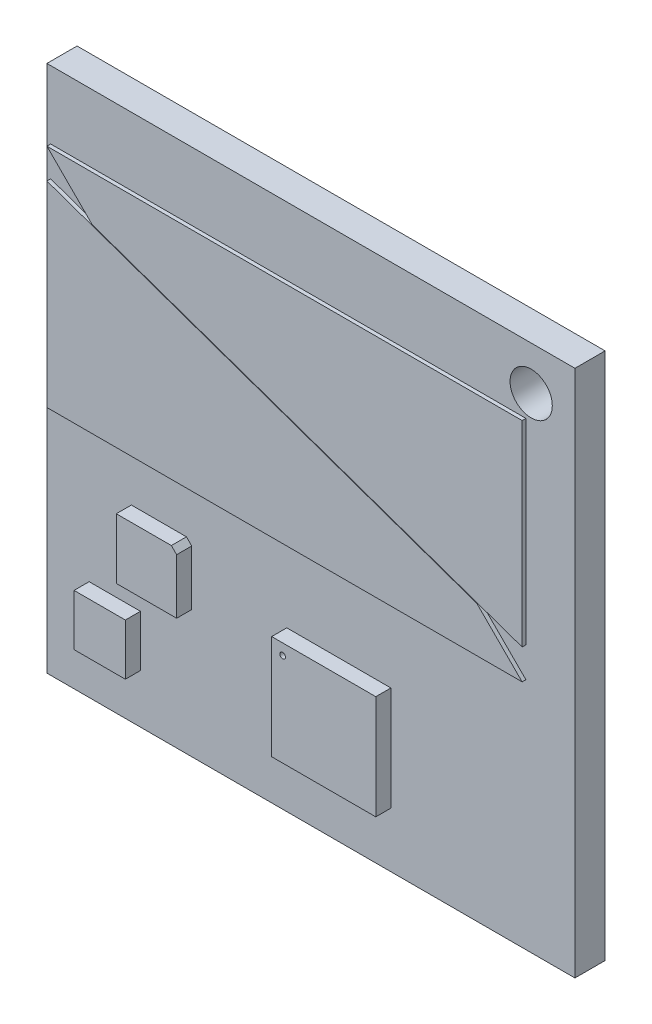
ISO-10303-21;
HEADER;
FILE_DESCRIPTION(('STEP AP214'),'2;1');
FILE_NAME('part.step','',(''),(''),'','','');
FILE_SCHEMA(('AUTOMOTIVE_DESIGN { 1 0 10303 214 1 1 1 1 }'));
ENDSEC;
DATA;
#1=APPLICATION_CONTEXT('core data for automotive mechanical design processes');
#2=APPLICATION_PROTOCOL_DEFINITION('international standard','automotive_design',2000,#1);
#3=PRODUCT_CONTEXT('',#1,'mechanical');
#4=PRODUCT('Part','Part','',(#3));
#5=PRODUCT_RELATED_PRODUCT_CATEGORY('part','',(#4));
#6=PRODUCT_DEFINITION_FORMATION('','',#4);
#7=PRODUCT_DEFINITION_CONTEXT('part definition',#1,'design');
#8=PRODUCT_DEFINITION('design','',#6,#7);
#9=PRODUCT_DEFINITION_SHAPE('','',#8);
#10=(LENGTH_UNIT() NAMED_UNIT(*) SI_UNIT(.MILLI.,.METRE.));
#11=(NAMED_UNIT(*) PLANE_ANGLE_UNIT() SI_UNIT($,.RADIAN.));
#12=(NAMED_UNIT(*) SI_UNIT($,.STERADIAN.) SOLID_ANGLE_UNIT());
#13=UNCERTAINTY_MEASURE_WITH_UNIT(LENGTH_MEASURE(1.E-05),#10,'distance_accuracy_value','');
#14=(GEOMETRIC_REPRESENTATION_CONTEXT(3) GLOBAL_UNCERTAINTY_ASSIGNED_CONTEXT((#13)) GLOBAL_UNIT_ASSIGNED_CONTEXT((#10,
#11,#12)) REPRESENTATION_CONTEXT('',''));
#15=CARTESIAN_POINT('',(0.,0.,0.));
#16=DIRECTION('',(0.,0.,1.));
#17=DIRECTION('',(1.,0.,0.));
#18=AXIS2_PLACEMENT_3D('',#15,#16,#17);
#19=CARTESIAN_POINT('',(0.,0.,0.));
#20=DIRECTION('',(0.,0.,1.));
#21=DIRECTION('',(1.,0.,0.));
#22=AXIS2_PLACEMENT_3D('',#19,#20,#21);
#23=PLANE('',#22);
#24=DIRECTION('',(1.,0.,0.));
#25=VECTOR('',#24,1.);
#26=CARTESIAN_POINT('',(0.,6.65,0.));
#27=LINE('',#26,#25);
#28=CARTESIAN_POINT('',(2.8,6.65,0.));
#29=VERTEX_POINT('',#28);
#30=CARTESIAN_POINT('',(6.2,6.65,0.));
#31=VERTEX_POINT('',#30);
#32=EDGE_CURVE('E333',#29,#31,#27,.T.);
#33=ORIENTED_EDGE('',*,*,#32,.T.);
#34=DIRECTION('',(0.,1.,0.));
#35=VECTOR('',#34,1.);
#36=CARTESIAN_POINT('',(6.2,0.,0.));
#37=LINE('',#36,#35);
#38=CARTESIAN_POINT('',(6.2,3.25,0.));
#39=VERTEX_POINT('',#38);
#40=EDGE_CURVE('E338',#39,#31,#37,.T.);
#41=ORIENTED_EDGE('',*,*,#40,.F.);
#42=DIRECTION('',(1.,0.,0.));
#43=VECTOR('',#42,1.);
#44=CARTESIAN_POINT('',(0.,3.25,0.));
#45=LINE('',#44,#43);
#46=CARTESIAN_POINT('',(2.8,3.25,0.));
#47=VERTEX_POINT('',#46);
#48=EDGE_CURVE('E349',#47,#39,#45,.T.);
#49=ORIENTED_EDGE('',*,*,#48,.F.);
#50=DIRECTION('',(0.,-1.,0.));
#51=VECTOR('',#50,1.);
#52=CARTESIAN_POINT('',(2.8,0.,0.));
#53=LINE('',#52,#51);
#54=EDGE_CURVE('E347',#29,#47,#53,.T.);
#55=ORIENTED_EDGE('',*,*,#54,.F.);
#56=EDGE_LOOP('',(#33,#41,#49,#55));
#57=FACE_BOUND('',#56,.T.);
#58=CARTESIAN_POINT('',(32.1,32.1,0.));
#59=DIRECTION('',(0.,0.,1.));
#60=DIRECTION('',(1.,0.,0.));
#61=AXIS2_PLACEMENT_3D('',#58,#59,#60);
#62=CIRCLE('',#61,1.4);
#63=CARTESIAN_POINT('',(33.5,32.1,0.));
#64=VERTEX_POINT('',#63);
#65=EDGE_CURVE('E396',#64,#64,#62,.T.);
#66=ORIENTED_EDGE('',*,*,#65,.F.);
#67=EDGE_LOOP('',(#66));
#68=FACE_BOUND('',#67,.T.);
#69=DIRECTION('',(0.,1.,0.));
#70=VECTOR('',#69,1.);
#71=CARTESIAN_POINT('',(35.,0.,0.));
#72=LINE('',#71,#70);
#73=CARTESIAN_POINT('',(35.,0.,0.));
#74=VERTEX_POINT('',#73);
#75=CARTESIAN_POINT('',(35.,35.,0.));
#76=VERTEX_POINT('',#75);
#77=EDGE_CURVE('E400',#74,#76,#72,.T.);
#78=ORIENTED_EDGE('',*,*,#77,.T.);
#79=DIRECTION('',(-1.,0.,0.));
#80=VECTOR('',#79,1.);
#81=CARTESIAN_POINT('',(35.,35.,0.));
#82=LINE('',#81,#80);
#83=CARTESIAN_POINT('',(0.,35.,0.));
#84=VERTEX_POINT('',#83);
#85=EDGE_CURVE('E419',#76,#84,#82,.T.);
#86=ORIENTED_EDGE('',*,*,#85,.T.);
#87=DIRECTION('',(0.,-1.,0.));
#88=VECTOR('',#87,1.);
#89=CARTESIAN_POINT('',(0.,35.,0.));
#90=LINE('',#89,#88);
#91=CARTESIAN_POINT('',(0.,0.,0.));
#92=VERTEX_POINT('',#91);
#93=EDGE_CURVE('E422',#84,#92,#90,.T.);
#94=ORIENTED_EDGE('',*,*,#93,.T.);
#95=DIRECTION('',(1.,0.,0.));
#96=VECTOR('',#95,1.);
#97=CARTESIAN_POINT('',(0.,0.,0.));
#98=LINE('',#97,#96);
#99=EDGE_CURVE('E407',#92,#74,#98,.T.);
#100=ORIENTED_EDGE('',*,*,#99,.T.);
#101=EDGE_LOOP('',(#78,#86,#94,#100));
#102=FACE_BOUND('',#101,.T.);
#103=DIRECTION('',(0.,1.,0.));
#104=VECTOR('',#103,1.);
#105=CARTESIAN_POINT('',(22.8,0.,0.));
#106=LINE('',#105,#104);
#107=CARTESIAN_POINT('',(22.8,3.65,0.));
#108=VERTEX_POINT('',#107);
#109=CARTESIAN_POINT('',(22.8,10.55,0.));
#110=VERTEX_POINT('',#109);
#111=EDGE_CURVE('E380',#108,#110,#106,.T.);
#112=ORIENTED_EDGE('',*,*,#111,.F.);
#113=DIRECTION('',(1.,0.,0.));
#114=VECTOR('',#113,1.);
#115=CARTESIAN_POINT('',(0.,3.65,0.));
#116=LINE('',#115,#114);
#117=CARTESIAN_POINT('',(15.9,3.65,0.));
#118=VERTEX_POINT('',#117);
#119=EDGE_CURVE('E362',#118,#108,#116,.T.);
#120=ORIENTED_EDGE('',*,*,#119,.F.);
#121=DIRECTION('',(0.,-1.,0.));
#122=VECTOR('',#121,1.);
#123=CARTESIAN_POINT('',(15.9,0.,0.));
#124=LINE('',#123,#122);
#125=CARTESIAN_POINT('',(15.9,10.55,0.));
#126=VERTEX_POINT('',#125);
#127=EDGE_CURVE('E367',#126,#118,#124,.T.);
#128=ORIENTED_EDGE('',*,*,#127,.F.);
#129=DIRECTION('',(1.,0.,0.));
#130=VECTOR('',#129,1.);
#131=CARTESIAN_POINT('',(0.,10.55,0.));
#132=LINE('',#131,#130);
#133=EDGE_CURVE('E383',#126,#110,#132,.T.);
#134=ORIENTED_EDGE('',*,*,#133,.T.);
#135=EDGE_LOOP('',(#112,#120,#128,#134));
#136=FACE_BOUND('',#135,.T.);
#137=DIRECTION('',(0.,1.,0.));
#138=VECTOR('',#137,1.);
#139=CARTESIAN_POINT('',(5.6,0.,0.));
#140=LINE('',#139,#138);
#141=CARTESIAN_POINT('',(5.6,8.45,0.));
#142=VERTEX_POINT('',#141);
#143=CARTESIAN_POINT('',(5.6,12.45,0.));
#144=VERTEX_POINT('',#143);
#145=EDGE_CURVE('E313',#142,#144,#140,.T.);
#146=ORIENTED_EDGE('',*,*,#145,.T.);
#147=DIRECTION('',(-1.,0.,0.));
#148=VECTOR('',#147,1.);
#149=CARTESIAN_POINT('',(0.,12.45,0.));
#150=LINE('',#149,#148);
#151=CARTESIAN_POINT('',(9.25,12.45,0.));
#152=VERTEX_POINT('',#151);
#153=EDGE_CURVE('E296',#152,#144,#150,.T.);
#154=ORIENTED_EDGE('',*,*,#153,.F.);
#155=DIRECTION('',(-0.707106781186548,0.707106781186548,0.));
#156=VECTOR('',#155,1.);
#157=CARTESIAN_POINT('',(10.85,10.85,0.));
#158=LINE('',#157,#156);
#159=CARTESIAN_POINT('',(9.6,12.1,0.));
#160=VERTEX_POINT('',#159);
#161=EDGE_CURVE('E300',#160,#152,#158,.T.);
#162=ORIENTED_EDGE('',*,*,#161,.F.);
#163=DIRECTION('',(0.,1.,0.));
#164=VECTOR('',#163,1.);
#165=CARTESIAN_POINT('',(9.59999999999996,0.,0.));
#166=LINE('',#165,#164);
#167=CARTESIAN_POINT('',(9.6,8.45,0.));
#168=VERTEX_POINT('',#167);
#169=EDGE_CURVE('E319',#168,#160,#166,.T.);
#170=ORIENTED_EDGE('',*,*,#169,.F.);
#171=DIRECTION('',(-1.,0.,0.));
#172=VECTOR('',#171,1.);
#173=CARTESIAN_POINT('',(0.,8.45,0.));
#174=LINE('',#173,#172);
#175=EDGE_CURVE('E316',#168,#142,#174,.T.);
#176=ORIENTED_EDGE('',*,*,#175,.T.);
#177=EDGE_LOOP('',(#146,#154,#162,#170,#176));
#178=FACE_BOUND('',#177,.T.);
#179=DIRECTION('',(0.943599982132881,-0.331087713029081,0.));
#180=VECTOR('',#179,1.);
#181=CARTESIAN_POINT('',(8.94765689229926,25.5008221430529,0.));
#182=LINE('',#181,#180);
#183=CARTESIAN_POINT('',(3.25,27.5,0.));
#184=VERTEX_POINT('',#183);
#185=CARTESIAN_POINT('',(31.75,17.5,0.));
#186=VERTEX_POINT('',#185);
#187=EDGE_CURVE('E279',#184,#186,#182,.T.);
#188=ORIENTED_EDGE('',*,*,#187,.F.);
#189=DIRECTION('',(0.707106781186548,-0.707106781186547,0.));
#190=VECTOR('',#189,1.);
#191=CARTESIAN_POINT('',(15.375,15.375,0.));
#192=LINE('',#191,#190);
#193=CARTESIAN_POINT('',(0.25,30.5,0.));
#194=VERTEX_POINT('',#193);
#195=EDGE_CURVE('E245',#194,#184,#192,.T.);
#196=ORIENTED_EDGE('',*,*,#195,.F.);
#197=DIRECTION('',(1.,0.,0.));
#198=VECTOR('',#197,1.);
#199=CARTESIAN_POINT('',(0.,30.5,0.));
#200=LINE('',#199,#198);
#201=CARTESIAN_POINT('',(31.75,30.5,0.));
#202=VERTEX_POINT('',#201);
#203=EDGE_CURVE('E268',#194,#202,#200,.T.);
#204=ORIENTED_EDGE('',*,*,#203,.T.);
#205=DIRECTION('',(0.,-1.,0.));
#206=VECTOR('',#205,1.);
#207=CARTESIAN_POINT('',(31.75,0.,0.));
#208=LINE('',#207,#206);
#209=EDGE_CURVE('E282',#202,#186,#208,.T.);
#210=ORIENTED_EDGE('',*,*,#209,.T.);
#211=EDGE_LOOP('',(#188,#196,#204,#210));
#212=FACE_BOUND('',#211,.T.);
#213=DIRECTION('',(0.707106781186547,-0.707106781186548,0.));
#214=VECTOR('',#213,1.);
#215=CARTESIAN_POINT('',(23.625,23.625,0.));
#216=LINE('',#215,#214);
#217=CARTESIAN_POINT('',(28.75,18.5,0.));
#218=VERTEX_POINT('',#217);
#219=CARTESIAN_POINT('',(31.75,15.5,0.));
#220=VERTEX_POINT('',#219);
#221=EDGE_CURVE('E75',#218,#220,#216,.T.);
#222=ORIENTED_EDGE('',*,*,#221,.T.);
#223=DIRECTION('',(1.,0.,0.));
#224=VECTOR('',#223,1.);
#225=CARTESIAN_POINT('',(0.,15.5,0.));
#226=LINE('',#225,#224);
#227=CARTESIAN_POINT('',(0.25,15.5,0.));
#228=VERTEX_POINT('',#227);
#229=EDGE_CURVE('E243',#228,#220,#226,.T.);
#230=ORIENTED_EDGE('',*,*,#229,.F.);
#231=DIRECTION('',(0.,1.,0.));
#232=VECTOR('',#231,1.);
#233=CARTESIAN_POINT('',(0.25,0.,0.));
#234=LINE('',#233,#232);
#235=CARTESIAN_POINT('',(0.25,28.5,0.));
#236=VERTEX_POINT('',#235);
#237=EDGE_CURVE('E238',#228,#236,#234,.T.);
#238=ORIENTED_EDGE('',*,*,#237,.T.);
#239=DIRECTION('',(0.943599982132881,-0.331087713029081,0.));
#240=VECTOR('',#239,1.);
#241=CARTESIAN_POINT('',(8.93121403124143,25.4539599890381,0.));
#242=LINE('',#241,#240);
#243=EDGE_CURVE('E80',#236,#218,#242,.T.);
#244=ORIENTED_EDGE('',*,*,#243,.T.);
#245=EDGE_LOOP('',(#222,#230,#238,#244));
#246=FACE_BOUND('',#245,.T.);
#247=ADVANCED_FACE('F60',(#57,#68,#102,#136,#178,#212,#246),#23,.T.);
#248=CARTESIAN_POINT('',(35.,0.,-2.));
#249=DIRECTION('',(1.,0.,0.));
#250=DIRECTION('',(0.,0.,-1.));
#251=AXIS2_PLACEMENT_3D('',#248,#249,#250);
#252=PLANE('',#251);
#253=ORIENTED_EDGE('',*,*,#77,.F.);
#254=DIRECTION('',(0.,0.,1.));
#255=VECTOR('',#254,1.);
#256=CARTESIAN_POINT('',(35.,0.,-2.));
#257=LINE('',#256,#255);
#258=CARTESIAN_POINT('',(35.,0.,-2.));
#259=VERTEX_POINT('',#258);
#260=EDGE_CURVE('E68',#259,#74,#257,.T.);
#261=ORIENTED_EDGE('',*,*,#260,.F.);
#262=DIRECTION('',(0.,1.,0.));
#263=VECTOR('',#262,1.);
#264=CARTESIAN_POINT('',(35.,0.,-2.));
#265=LINE('',#264,#263);
#266=CARTESIAN_POINT('',(35.,35.,-2.));
#267=VERTEX_POINT('',#266);
#268=EDGE_CURVE('E403',#259,#267,#265,.T.);
#269=ORIENTED_EDGE('',*,*,#268,.T.);
#270=DIRECTION('',(0.,0.,1.));
#271=VECTOR('',#270,1.);
#272=CARTESIAN_POINT('',(35.,35.,-2.));
#273=LINE('',#272,#271);
#274=EDGE_CURVE('E416',#267,#76,#273,.T.);
#275=ORIENTED_EDGE('',*,*,#274,.T.);
#276=EDGE_LOOP('',(#253,#261,#269,#275));
#277=FACE_BOUND('',#276,.T.);
#278=ADVANCED_FACE('F62',(#277),#252,.T.);
#279=CARTESIAN_POINT('',(0.,0.,-2.));
#280=DIRECTION('',(0.,-1.,0.));
#281=DIRECTION('',(0.,0.,-1.));
#282=AXIS2_PLACEMENT_3D('',#279,#280,#281);
#283=PLANE('',#282);
#284=ORIENTED_EDGE('',*,*,#99,.F.);
#285=DIRECTION('',(0.,0.,1.));
#286=VECTOR('',#285,1.);
#287=CARTESIAN_POINT('',(0.,0.,-2.));
#288=LINE('',#287,#286);
#289=CARTESIAN_POINT('',(0.,0.,-2.));
#290=VERTEX_POINT('',#289);
#291=EDGE_CURVE('E428',#290,#92,#288,.T.);
#292=ORIENTED_EDGE('',*,*,#291,.F.);
#293=DIRECTION('',(1.,0.,0.));
#294=VECTOR('',#293,1.);
#295=CARTESIAN_POINT('',(0.,0.,-2.));
#296=LINE('',#295,#294);
#297=EDGE_CURVE('E413',#290,#259,#296,.T.);
#298=ORIENTED_EDGE('',*,*,#297,.T.);
#299=ORIENTED_EDGE('',*,*,#260,.T.);
#300=EDGE_LOOP('',(#284,#292,#298,#299));
#301=FACE_BOUND('',#300,.T.);
#302=ADVANCED_FACE('F443',(#301),#283,.T.);
#303=CARTESIAN_POINT('',(0.,35.,-2.));
#304=DIRECTION('',(-1.,0.,0.));
#305=DIRECTION('',(0.,0.,1.));
#306=AXIS2_PLACEMENT_3D('',#303,#304,#305);
#307=PLANE('',#306);
#308=ORIENTED_EDGE('',*,*,#93,.F.);
#309=DIRECTION('',(0.,0.,1.));
#310=VECTOR('',#309,1.);
#311=CARTESIAN_POINT('',(0.,35.,-2.));
#312=LINE('',#311,#310);
#313=CARTESIAN_POINT('',(0.,35.,-2.));
#314=VERTEX_POINT('',#313);
#315=EDGE_CURVE('E430',#314,#84,#312,.T.);
#316=ORIENTED_EDGE('',*,*,#315,.F.);
#317=DIRECTION('',(0.,-1.,0.));
#318=VECTOR('',#317,1.);
#319=CARTESIAN_POINT('',(0.,35.,-2.));
#320=LINE('',#319,#318);
#321=EDGE_CURVE('E410',#314,#290,#320,.T.);
#322=ORIENTED_EDGE('',*,*,#321,.T.);
#323=ORIENTED_EDGE('',*,*,#291,.T.);
#324=EDGE_LOOP('',(#308,#316,#322,#323));
#325=FACE_BOUND('',#324,.T.);
#326=ADVANCED_FACE('F449',(#325),#307,.T.);
#327=CARTESIAN_POINT('',(35.,35.,-2.));
#328=DIRECTION('',(0.,1.,0.));
#329=DIRECTION('',(0.,0.,1.));
#330=AXIS2_PLACEMENT_3D('',#327,#328,#329);
#331=PLANE('',#330);
#332=ORIENTED_EDGE('',*,*,#85,.F.);
#333=ORIENTED_EDGE('',*,*,#274,.F.);
#334=DIRECTION('',(-1.,0.,0.));
#335=VECTOR('',#334,1.);
#336=CARTESIAN_POINT('',(35.,35.,-2.));
#337=LINE('',#336,#335);
#338=EDGE_CURVE('E406',#267,#314,#337,.T.);
#339=ORIENTED_EDGE('',*,*,#338,.T.);
#340=ORIENTED_EDGE('',*,*,#315,.T.);
#341=EDGE_LOOP('',(#332,#333,#339,#340));
#342=FACE_BOUND('',#341,.T.);
#343=ADVANCED_FACE('F437',(#342),#331,.T.);
#344=CARTESIAN_POINT('',(0.,0.,-2.));
#345=DIRECTION('',(0.,0.,1.));
#346=DIRECTION('',(1.,0.,0.));
#347=AXIS2_PLACEMENT_3D('',#344,#345,#346);
#348=PLANE('',#347);
#349=CARTESIAN_POINT('',(32.1,32.1,-2.));
#350=DIRECTION('',(0.,0.,1.));
#351=DIRECTION('',(1.,0.,0.));
#352=AXIS2_PLACEMENT_3D('',#349,#350,#351);
#353=CIRCLE('',#352,1.4);
#354=CARTESIAN_POINT('',(33.5,32.1,-2.));
#355=VERTEX_POINT('',#354);
#356=EDGE_CURVE('E397',#355,#355,#353,.T.);
#357=ORIENTED_EDGE('',*,*,#356,.T.);
#358=EDGE_LOOP('',(#357));
#359=FACE_BOUND('',#358,.T.);
#360=ORIENTED_EDGE('',*,*,#268,.F.);
#361=ORIENTED_EDGE('',*,*,#297,.F.);
#362=ORIENTED_EDGE('',*,*,#321,.F.);
#363=ORIENTED_EDGE('',*,*,#338,.F.);
#364=EDGE_LOOP('',(#360,#361,#362,#363));
#365=FACE_BOUND('',#364,.T.);
#366=ADVANCED_FACE('F446',(#359,#365),#348,.F.);
#367=CARTESIAN_POINT('',(32.1,32.1,-2.));
#368=DIRECTION('',(0.,0.,1.));
#369=DIRECTION('',(1.,0.,0.));
#370=AXIS2_PLACEMENT_3D('',#367,#368,#369);
#371=CYLINDRICAL_SURFACE('',#370,1.4);
#372=ORIENTED_EDGE('',*,*,#356,.F.);
#373=EDGE_LOOP('',(#372));
#374=FACE_BOUND('',#373,.T.);
#375=ORIENTED_EDGE('',*,*,#65,.T.);
#376=EDGE_LOOP('',(#375));
#377=FACE_BOUND('',#376,.T.);
#378=ADVANCED_FACE('F500',(#374,#377),#371,.F.);
#379=CARTESIAN_POINT('',(0.,3.65,1.));
#380=DIRECTION('',(0.,1.,0.));
#381=DIRECTION('',(0.,0.,1.));
#382=AXIS2_PLACEMENT_3D('',#379,#380,#381);
#383=PLANE('',#382);
#384=ORIENTED_EDGE('',*,*,#119,.T.);
#385=DIRECTION('',(0.,0.,-1.));
#386=VECTOR('',#385,1.);
#387=CARTESIAN_POINT('',(22.8,3.65,1.));
#388=LINE('',#387,#386);
#389=CARTESIAN_POINT('',(22.8,3.65,1.));
#390=VERTEX_POINT('',#389);
#391=EDGE_CURVE('E394',#390,#108,#388,.T.);
#392=ORIENTED_EDGE('',*,*,#391,.F.);
#393=DIRECTION('',(1.,0.,0.));
#394=VECTOR('',#393,1.);
#395=CARTESIAN_POINT('',(0.,3.65,1.));
#396=LINE('',#395,#394);
#397=CARTESIAN_POINT('',(15.9,3.65,1.));
#398=VERTEX_POINT('',#397);
#399=EDGE_CURVE('E366',#398,#390,#396,.T.);
#400=ORIENTED_EDGE('',*,*,#399,.F.);
#401=DIRECTION('',(0.,0.,-1.));
#402=VECTOR('',#401,1.);
#403=CARTESIAN_POINT('',(15.9,3.65,1.));
#404=LINE('',#403,#402);
#405=EDGE_CURVE('E377',#398,#118,#404,.T.);
#406=ORIENTED_EDGE('',*,*,#405,.T.);
#407=EDGE_LOOP('',(#384,#392,#400,#406));
#408=FACE_BOUND('',#407,.T.);
#409=ADVANCED_FACE('F498',(#408),#383,.F.);
#410=CARTESIAN_POINT('',(22.8,0.,1.));
#411=DIRECTION('',(-1.,0.,0.));
#412=DIRECTION('',(0.,0.,1.));
#413=AXIS2_PLACEMENT_3D('',#410,#411,#412);
#414=PLANE('',#413);
#415=ORIENTED_EDGE('',*,*,#111,.T.);
#416=DIRECTION('',(0.,0.,-1.));
#417=VECTOR('',#416,1.);
#418=CARTESIAN_POINT('',(22.8,10.55,1.));
#419=LINE('',#418,#417);
#420=CARTESIAN_POINT('',(22.8,10.55,1.));
#421=VERTEX_POINT('',#420);
#422=EDGE_CURVE('E392',#421,#110,#419,.T.);
#423=ORIENTED_EDGE('',*,*,#422,.F.);
#424=DIRECTION('',(0.,1.,0.));
#425=VECTOR('',#424,1.);
#426=CARTESIAN_POINT('',(22.8,0.,1.));
#427=LINE('',#426,#425);
#428=EDGE_CURVE('E370',#390,#421,#427,.T.);
#429=ORIENTED_EDGE('',*,*,#428,.F.);
#430=ORIENTED_EDGE('',*,*,#391,.T.);
#431=EDGE_LOOP('',(#415,#423,#429,#430));
#432=FACE_BOUND('',#431,.T.);
#433=ADVANCED_FACE('F493',(#432),#414,.F.);
#434=CARTESIAN_POINT('',(0.,10.55,1.));
#435=DIRECTION('',(0.,1.,0.));
#436=DIRECTION('',(0.,0.,1.));
#437=AXIS2_PLACEMENT_3D('',#434,#435,#436);
#438=PLANE('',#437);
#439=ORIENTED_EDGE('',*,*,#133,.F.);
#440=DIRECTION('',(0.,0.,-1.));
#441=VECTOR('',#440,1.);
#442=CARTESIAN_POINT('',(15.9,10.55,1.));
#443=LINE('',#442,#441);
#444=CARTESIAN_POINT('',(15.9,10.55,1.));
#445=VERTEX_POINT('',#444);
#446=EDGE_CURVE('E389',#445,#126,#443,.T.);
#447=ORIENTED_EDGE('',*,*,#446,.F.);
#448=DIRECTION('',(1.,0.,0.));
#449=VECTOR('',#448,1.);
#450=CARTESIAN_POINT('',(0.,10.55,1.));
#451=LINE('',#450,#449);
#452=EDGE_CURVE('E372',#445,#421,#451,.T.);
#453=ORIENTED_EDGE('',*,*,#452,.T.);
#454=ORIENTED_EDGE('',*,*,#422,.T.);
#455=EDGE_LOOP('',(#439,#447,#453,#454));
#456=FACE_BOUND('',#455,.T.);
#457=ADVANCED_FACE('F484',(#456),#438,.T.);
#458=CARTESIAN_POINT('',(16.63,9.82,1.));
#459=DIRECTION('',(0.,0.,-1.));
#460=DIRECTION('',(-1.,0.,0.));
#461=AXIS2_PLACEMENT_3D('',#458,#459,#460);
#462=CYLINDRICAL_SURFACE('',#461,0.1855);
#463=CARTESIAN_POINT('',(16.63,9.82,1.));
#464=DIRECTION('',(0.,0.,1.));
#465=DIRECTION('',(1.,0.,0.));
#466=AXIS2_PLACEMENT_3D('',#463,#464,#465);
#467=CIRCLE('',#466,0.1855);
#468=CARTESIAN_POINT('',(16.8155,9.82,1.));
#469=VERTEX_POINT('',#468);
#470=EDGE_CURVE('E363',#469,#469,#467,.T.);
#471=ORIENTED_EDGE('',*,*,#470,.T.);
#472=EDGE_LOOP('',(#471));
#473=FACE_BOUND('',#472,.T.);
#474=CARTESIAN_POINT('',(16.63,9.82,0.));
#475=DIRECTION('',(0.,0.,1.));
#476=DIRECTION('',(1.,0.,0.));
#477=AXIS2_PLACEMENT_3D('',#474,#475,#476);
#478=CIRCLE('',#477,0.1855);
#479=CARTESIAN_POINT('',(16.8155,9.82,0.));
#480=VERTEX_POINT('',#479);
#481=EDGE_CURVE('E12',#480,#480,#478,.F.);
#482=ORIENTED_EDGE('',*,*,#481,.T.);
#483=EDGE_LOOP('',(#482));
#484=FACE_BOUND('',#483,.T.);
#485=ADVANCED_FACE('F482',(#473,#484),#462,.F.);
#486=CARTESIAN_POINT('',(15.9,0.,1.));
#487=DIRECTION('',(1.,0.,0.));
#488=DIRECTION('',(0.,0.,-1.));
#489=AXIS2_PLACEMENT_3D('',#486,#487,#488);
#490=PLANE('',#489);
#491=ORIENTED_EDGE('',*,*,#127,.T.);
#492=ORIENTED_EDGE('',*,*,#405,.F.);
#493=DIRECTION('',(0.,-1.,0.));
#494=VECTOR('',#493,1.);
#495=CARTESIAN_POINT('',(15.9,0.,1.));
#496=LINE('',#495,#494);
#497=EDGE_CURVE('E375',#445,#398,#496,.T.);
#498=ORIENTED_EDGE('',*,*,#497,.F.);
#499=ORIENTED_EDGE('',*,*,#446,.T.);
#500=EDGE_LOOP('',(#491,#492,#498,#499));
#501=FACE_BOUND('',#500,.T.);
#502=ADVANCED_FACE('F477',(#501),#490,.F.);
#503=CARTESIAN_POINT('',(0.,0.,1.));
#504=DIRECTION('',(0.,0.,1.));
#505=DIRECTION('',(1.,0.,0.));
#506=AXIS2_PLACEMENT_3D('',#503,#504,#505);
#507=PLANE('',#506);
#508=ORIENTED_EDGE('',*,*,#470,.F.);
#509=EDGE_LOOP('',(#508));
#510=FACE_BOUND('',#509,.T.);
#511=ORIENTED_EDGE('',*,*,#399,.T.);
#512=ORIENTED_EDGE('',*,*,#428,.T.);
#513=ORIENTED_EDGE('',*,*,#452,.F.);
#514=ORIENTED_EDGE('',*,*,#497,.T.);
#515=EDGE_LOOP('',(#511,#512,#513,#514));
#516=FACE_BOUND('',#515,.T.);
#517=ADVANCED_FACE('F468',(#510,#516),#507,.T.);
#518=ORIENTED_EDGE('',*,*,#481,.F.);
#519=EDGE_LOOP('',(#518));
#520=FACE_BOUND('',#519,.T.);
#521=ADVANCED_FACE('F460',(#520),#23,.T.);
#522=CARTESIAN_POINT('',(0.,6.65,1.));
#523=DIRECTION('',(0.,1.,0.));
#524=DIRECTION('',(0.,0.,1.));
#525=AXIS2_PLACEMENT_3D('',#522,#523,#524);
#526=PLANE('',#525);
#527=ORIENTED_EDGE('',*,*,#32,.F.);
#528=DIRECTION('',(0.,0.,-1.));
#529=VECTOR('',#528,1.);
#530=CARTESIAN_POINT('',(2.8,6.65,1.));
#531=LINE('',#530,#529);
#532=CARTESIAN_POINT('',(2.8,6.65,1.));
#533=VERTEX_POINT('',#532);
#534=EDGE_CURVE('E360',#533,#29,#531,.T.);
#535=ORIENTED_EDGE('',*,*,#534,.F.);
#536=DIRECTION('',(1.,0.,0.));
#537=VECTOR('',#536,1.);
#538=CARTESIAN_POINT('',(0.,6.65,1.));
#539=LINE('',#538,#537);
#540=CARTESIAN_POINT('',(6.2,6.65,1.));
#541=VERTEX_POINT('',#540);
#542=EDGE_CURVE('E334',#533,#541,#539,.T.);
#543=ORIENTED_EDGE('',*,*,#542,.T.);
#544=DIRECTION('',(0.,0.,-1.));
#545=VECTOR('',#544,1.);
#546=CARTESIAN_POINT('',(6.2,6.65,1.));
#547=LINE('',#546,#545);
#548=EDGE_CURVE('E344',#541,#31,#547,.T.);
#549=ORIENTED_EDGE('',*,*,#548,.T.);
#550=EDGE_LOOP('',(#527,#535,#543,#549));
#551=FACE_BOUND('',#550,.T.);
#552=ADVANCED_FACE('F467',(#551),#526,.T.);
#553=CARTESIAN_POINT('',(2.8,0.,1.));
#554=DIRECTION('',(1.,0.,0.));
#555=DIRECTION('',(0.,1.,0.));
#556=AXIS2_PLACEMENT_3D('',#553,#554,#555);
#557=PLANE('',#556);
#558=ORIENTED_EDGE('',*,*,#54,.T.);
#559=DIRECTION('',(0.,0.,-1.));
#560=VECTOR('',#559,1.);
#561=CARTESIAN_POINT('',(2.8,3.25,1.));
#562=LINE('',#561,#560);
#563=CARTESIAN_POINT('',(2.8,3.25,1.));
#564=VERTEX_POINT('',#563);
#565=EDGE_CURVE('E357',#564,#47,#562,.T.);
#566=ORIENTED_EDGE('',*,*,#565,.F.);
#567=DIRECTION('',(0.,-1.,0.));
#568=VECTOR('',#567,1.);
#569=CARTESIAN_POINT('',(2.8,0.,1.));
#570=LINE('',#569,#568);
#571=EDGE_CURVE('E337',#533,#564,#570,.T.);
#572=ORIENTED_EDGE('',*,*,#571,.F.);
#573=ORIENTED_EDGE('',*,*,#534,.T.);
#574=EDGE_LOOP('',(#558,#566,#572,#573));
#575=FACE_BOUND('',#574,.T.);
#576=ADVANCED_FACE('F474',(#575),#557,.F.);
#577=CARTESIAN_POINT('',(0.,3.25,1.));
#578=DIRECTION('',(0.,1.,0.));
#579=DIRECTION('',(0.,0.,1.));
#580=AXIS2_PLACEMENT_3D('',#577,#578,#579);
#581=PLANE('',#580);
#582=ORIENTED_EDGE('',*,*,#48,.T.);
#583=DIRECTION('',(0.,0.,-1.));
#584=VECTOR('',#583,1.);
#585=CARTESIAN_POINT('',(6.2,3.25,1.));
#586=LINE('',#585,#584);
#587=CARTESIAN_POINT('',(6.2,3.25,1.));
#588=VERTEX_POINT('',#587);
#589=EDGE_CURVE('E355',#588,#39,#586,.T.);
#590=ORIENTED_EDGE('',*,*,#589,.F.);
#591=DIRECTION('',(1.,0.,0.));
#592=VECTOR('',#591,1.);
#593=CARTESIAN_POINT('',(0.,3.25,1.));
#594=LINE('',#593,#592);
#595=EDGE_CURVE('E340',#564,#588,#594,.T.);
#596=ORIENTED_EDGE('',*,*,#595,.F.);
#597=ORIENTED_EDGE('',*,*,#565,.T.);
#598=EDGE_LOOP('',(#582,#590,#596,#597));
#599=FACE_BOUND('',#598,.T.);
#600=ADVANCED_FACE('F569',(#599),#581,.F.);
#601=CARTESIAN_POINT('',(6.2,0.,1.));
#602=DIRECTION('',(-1.,0.,0.));
#603=DIRECTION('',(0.,0.,1.));
#604=AXIS2_PLACEMENT_3D('',#601,#602,#603);
#605=PLANE('',#604);
#606=ORIENTED_EDGE('',*,*,#40,.T.);
#607=ORIENTED_EDGE('',*,*,#548,.F.);
#608=DIRECTION('',(0.,1.,0.));
#609=VECTOR('',#608,1.);
#610=CARTESIAN_POINT('',(6.2,0.,1.));
#611=LINE('',#610,#609);
#612=EDGE_CURVE('E342',#588,#541,#611,.T.);
#613=ORIENTED_EDGE('',*,*,#612,.F.);
#614=ORIENTED_EDGE('',*,*,#589,.T.);
#615=EDGE_LOOP('',(#606,#607,#613,#614));
#616=FACE_BOUND('',#615,.T.);
#617=ADVANCED_FACE('F581',(#616),#605,.F.);
#618=CARTESIAN_POINT('',(0.,0.,1.));
#619=DIRECTION('',(0.,0.,1.));
#620=DIRECTION('',(1.,0.,0.));
#621=AXIS2_PLACEMENT_3D('',#618,#619,#620);
#622=PLANE('',#621);
#623=ORIENTED_EDGE('',*,*,#542,.F.);
#624=ORIENTED_EDGE('',*,*,#571,.T.);
#625=ORIENTED_EDGE('',*,*,#595,.T.);
#626=ORIENTED_EDGE('',*,*,#612,.T.);
#627=EDGE_LOOP('',(#623,#624,#625,#626));
#628=FACE_BOUND('',#627,.T.);
#629=ADVANCED_FACE('F593',(#628),#622,.T.);
#630=CARTESIAN_POINT('',(0.,12.45,1.));
#631=DIRECTION('',(0.,-1.,0.));
#632=DIRECTION('',(0.,0.,-1.));
#633=AXIS2_PLACEMENT_3D('',#630,#631,#632);
#634=PLANE('',#633);
#635=ORIENTED_EDGE('',*,*,#153,.T.);
#636=DIRECTION('',(0.,0.,-1.));
#637=VECTOR('',#636,1.);
#638=CARTESIAN_POINT('',(5.6,12.45,1.));
#639=LINE('',#638,#637);
#640=CARTESIAN_POINT('',(5.6,12.45,1.));
#641=VERTEX_POINT('',#640);
#642=EDGE_CURVE('E331',#641,#144,#639,.T.);
#643=ORIENTED_EDGE('',*,*,#642,.F.);
#644=DIRECTION('',(-1.,0.,0.));
#645=VECTOR('',#644,1.);
#646=CARTESIAN_POINT('',(0.,12.45,1.));
#647=LINE('',#646,#645);
#648=CARTESIAN_POINT('',(9.25,12.45,1.));
#649=VERTEX_POINT('',#648);
#650=EDGE_CURVE('E297',#649,#641,#647,.T.);
#651=ORIENTED_EDGE('',*,*,#650,.F.);
#652=DIRECTION('',(0.,0.,-1.));
#653=VECTOR('',#652,1.);
#654=CARTESIAN_POINT('',(9.25,12.45,1.));
#655=LINE('',#654,#653);
#656=EDGE_CURVE('E310',#649,#152,#655,.T.);
#657=ORIENTED_EDGE('',*,*,#656,.T.);
#658=EDGE_LOOP('',(#635,#643,#651,#657));
#659=FACE_BOUND('',#658,.T.);
#660=ADVANCED_FACE('F603',(#659),#634,.F.);
#661=CARTESIAN_POINT('',(5.6,0.,1.));
#662=DIRECTION('',(-1.,0.,0.));
#663=DIRECTION('',(0.,0.,1.));
#664=AXIS2_PLACEMENT_3D('',#661,#662,#663);
#665=PLANE('',#664);
#666=ORIENTED_EDGE('',*,*,#145,.F.);
#667=DIRECTION('',(0.,0.,-1.));
#668=VECTOR('',#667,1.);
#669=CARTESIAN_POINT('',(5.6,8.45,1.));
#670=LINE('',#669,#668);
#671=CARTESIAN_POINT('',(5.6,8.45,1.));
#672=VERTEX_POINT('',#671);
#673=EDGE_CURVE('E329',#672,#142,#670,.T.);
#674=ORIENTED_EDGE('',*,*,#673,.F.);
#675=DIRECTION('',(0.,1.,0.));
#676=VECTOR('',#675,1.);
#677=CARTESIAN_POINT('',(5.6,0.,1.));
#678=LINE('',#677,#676);
#679=EDGE_CURVE('E299',#672,#641,#678,.T.);
#680=ORIENTED_EDGE('',*,*,#679,.T.);
#681=ORIENTED_EDGE('',*,*,#642,.T.);
#682=EDGE_LOOP('',(#666,#674,#680,#681));
#683=FACE_BOUND('',#682,.T.);
#684=ADVANCED_FACE('F614',(#683),#665,.T.);
#685=CARTESIAN_POINT('',(0.,8.45,1.));
#686=DIRECTION('',(0.,-1.,0.));
#687=DIRECTION('',(0.,0.,-1.));
#688=AXIS2_PLACEMENT_3D('',#685,#686,#687);
#689=PLANE('',#688);
#690=ORIENTED_EDGE('',*,*,#175,.F.);
#691=DIRECTION('',(0.,0.,-1.));
#692=VECTOR('',#691,1.);
#693=CARTESIAN_POINT('',(9.6,8.45,1.));
#694=LINE('',#693,#692);
#695=CARTESIAN_POINT('',(9.6,8.45,1.));
#696=VERTEX_POINT('',#695);
#697=EDGE_CURVE('E327',#696,#168,#694,.T.);
#698=ORIENTED_EDGE('',*,*,#697,.F.);
#699=DIRECTION('',(-1.,0.,0.));
#700=VECTOR('',#699,1.);
#701=CARTESIAN_POINT('',(0.,8.45,1.));
#702=LINE('',#701,#700);
#703=EDGE_CURVE('E303',#696,#672,#702,.T.);
#704=ORIENTED_EDGE('',*,*,#703,.T.);
#705=ORIENTED_EDGE('',*,*,#673,.T.);
#706=EDGE_LOOP('',(#690,#698,#704,#705));
#707=FACE_BOUND('',#706,.T.);
#708=ADVANCED_FACE('F625',(#707),#689,.T.);
#709=CARTESIAN_POINT('',(9.59999999999996,0.,1.));
#710=DIRECTION('',(-1.,0.,0.));
#711=DIRECTION('',(0.,-1.,0.));
#712=AXIS2_PLACEMENT_3D('',#709,#710,#711);
#713=PLANE('',#712);
#714=ORIENTED_EDGE('',*,*,#169,.T.);
#715=DIRECTION('',(0.,0.,-1.));
#716=VECTOR('',#715,1.);
#717=CARTESIAN_POINT('',(9.6,12.1,1.));
#718=LINE('',#717,#716);
#719=CARTESIAN_POINT('',(9.6,12.1,1.));
#720=VERTEX_POINT('',#719);
#721=EDGE_CURVE('E325',#720,#160,#718,.T.);
#722=ORIENTED_EDGE('',*,*,#721,.F.);
#723=DIRECTION('',(0.,1.,0.));
#724=VECTOR('',#723,1.);
#725=CARTESIAN_POINT('',(9.59999999999996,0.,1.));
#726=LINE('',#725,#724);
#727=EDGE_CURVE('E306',#696,#720,#726,.T.);
#728=ORIENTED_EDGE('',*,*,#727,.F.);
#729=ORIENTED_EDGE('',*,*,#697,.T.);
#730=EDGE_LOOP('',(#714,#722,#728,#729));
#731=FACE_BOUND('',#730,.T.);
#732=ADVANCED_FACE('F637',(#731),#713,.F.);
#733=CARTESIAN_POINT('',(10.85,10.85,1.));
#734=DIRECTION('',(-0.707106781186547,-0.707106781186547,0.));
#735=DIRECTION('',(0.707106781186548,-0.707106781186548,0.));
#736=AXIS2_PLACEMENT_3D('',#733,#734,#735);
#737=PLANE('',#736);
#738=ORIENTED_EDGE('',*,*,#161,.T.);
#739=ORIENTED_EDGE('',*,*,#656,.F.);
#740=DIRECTION('',(-0.707106781186548,0.707106781186548,0.));
#741=VECTOR('',#740,1.);
#742=CARTESIAN_POINT('',(10.85,10.85,1.));
#743=LINE('',#742,#741);
#744=EDGE_CURVE('E308',#720,#649,#743,.T.);
#745=ORIENTED_EDGE('',*,*,#744,.F.);
#746=ORIENTED_EDGE('',*,*,#721,.T.);
#747=EDGE_LOOP('',(#738,#739,#745,#746));
#748=FACE_BOUND('',#747,.T.);
#749=ADVANCED_FACE('F649',(#748),#737,.F.);
#750=CARTESIAN_POINT('',(0.,0.,1.));
#751=DIRECTION('',(0.,0.,1.));
#752=DIRECTION('',(1.,0.,0.));
#753=AXIS2_PLACEMENT_3D('',#750,#751,#752);
#754=PLANE('',#753);
#755=ORIENTED_EDGE('',*,*,#650,.T.);
#756=ORIENTED_EDGE('',*,*,#679,.F.);
#757=ORIENTED_EDGE('',*,*,#703,.F.);
#758=ORIENTED_EDGE('',*,*,#727,.T.);
#759=ORIENTED_EDGE('',*,*,#744,.T.);
#760=EDGE_LOOP('',(#755,#756,#757,#758,#759));
#761=FACE_BOUND('',#760,.T.);
#762=ADVANCED_FACE('F659',(#761),#754,.T.);
#763=CARTESIAN_POINT('',(15.375,15.375,0.25));
#764=DIRECTION('',(0.707106781186547,0.707106781186548,0.));
#765=DIRECTION('',(-0.707106781186548,0.707106781186547,0.));
#766=AXIS2_PLACEMENT_3D('',#763,#764,#765);
#767=PLANE('',#766);
#768=ORIENTED_EDGE('',*,*,#195,.T.);
#769=DIRECTION('',(0.,0.,-1.));
#770=VECTOR('',#769,1.);
#771=CARTESIAN_POINT('',(3.25,27.5,0.25));
#772=LINE('',#771,#770);
#773=CARTESIAN_POINT('',(3.25,27.5,0.25));
#774=VERTEX_POINT('',#773);
#775=EDGE_CURVE('E293',#774,#184,#772,.T.);
#776=ORIENTED_EDGE('',*,*,#775,.F.);
#777=DIRECTION('',(0.707106781186548,-0.707106781186547,0.));
#778=VECTOR('',#777,1.);
#779=CARTESIAN_POINT('',(15.375,15.375,0.25));
#780=LINE('',#779,#778);
#781=CARTESIAN_POINT('',(0.25,30.5,0.25));
#782=VERTEX_POINT('',#781);
#783=EDGE_CURVE('E264',#782,#774,#780,.T.);
#784=ORIENTED_EDGE('',*,*,#783,.F.);
#785=DIRECTION('',(0.,0.,-1.));
#786=VECTOR('',#785,1.);
#787=CARTESIAN_POINT('',(0.25,30.5,0.25));
#788=LINE('',#787,#786);
#789=EDGE_CURVE('E276',#782,#194,#788,.T.);
#790=ORIENTED_EDGE('',*,*,#789,.T.);
#791=EDGE_LOOP('',(#768,#776,#784,#790));
#792=FACE_BOUND('',#791,.T.);
#793=ADVANCED_FACE('F668',(#792),#767,.F.);
#794=CARTESIAN_POINT('',(8.94765689229926,25.5008221430529,0.25));
#795=DIRECTION('',(0.331087713029081,0.943599982132881,0.));
#796=DIRECTION('',(-0.943599982132881,0.331087713029081,0.));
#797=AXIS2_PLACEMENT_3D('',#794,#795,#796);
#798=PLANE('',#797);
#799=ORIENTED_EDGE('',*,*,#187,.T.);
#800=DIRECTION('',(0.,0.,-1.));
#801=VECTOR('',#800,1.);
#802=CARTESIAN_POINT('',(31.75,17.5,0.25));
#803=LINE('',#802,#801);
#804=CARTESIAN_POINT('',(31.75,17.5,0.25));
#805=VERTEX_POINT('',#804);
#806=EDGE_CURVE('E290',#805,#186,#803,.T.);
#807=ORIENTED_EDGE('',*,*,#806,.F.);
#808=DIRECTION('',(0.943599982132881,-0.331087713029081,0.));
#809=VECTOR('',#808,1.);
#810=CARTESIAN_POINT('',(8.94765689229926,25.5008221430529,0.25));
#811=LINE('',#810,#809);
#812=EDGE_CURVE('E267',#774,#805,#811,.T.);
#813=ORIENTED_EDGE('',*,*,#812,.F.);
#814=ORIENTED_EDGE('',*,*,#775,.T.);
#815=EDGE_LOOP('',(#799,#807,#813,#814));
#816=FACE_BOUND('',#815,.T.);
#817=ADVANCED_FACE('F683',(#816),#798,.F.);
#818=CARTESIAN_POINT('',(31.75,0.,0.25));
#819=DIRECTION('',(1.,0.,0.));
#820=DIRECTION('',(0.,0.,-1.));
#821=AXIS2_PLACEMENT_3D('',#818,#819,#820);
#822=PLANE('',#821);
#823=ORIENTED_EDGE('',*,*,#209,.F.);
#824=DIRECTION('',(0.,0.,-1.));
#825=VECTOR('',#824,1.);
#826=CARTESIAN_POINT('',(31.75,30.5,0.25));
#827=LINE('',#826,#825);
#828=CARTESIAN_POINT('',(31.75,30.5,0.25));
#829=VERTEX_POINT('',#828);
#830=EDGE_CURVE('E287',#829,#202,#827,.T.);
#831=ORIENTED_EDGE('',*,*,#830,.F.);
#832=DIRECTION('',(0.,-1.,0.));
#833=VECTOR('',#832,1.);
#834=CARTESIAN_POINT('',(31.75,0.,0.25));
#835=LINE('',#834,#833);
#836=EDGE_CURVE('E270',#829,#805,#835,.T.);
#837=ORIENTED_EDGE('',*,*,#836,.T.);
#838=ORIENTED_EDGE('',*,*,#806,.T.);
#839=EDGE_LOOP('',(#823,#831,#837,#838));
#840=FACE_BOUND('',#839,.T.);
#841=ADVANCED_FACE('F693',(#840),#822,.T.);
#842=CARTESIAN_POINT('',(0.,30.5,0.25));
#843=DIRECTION('',(0.,1.,0.));
#844=DIRECTION('',(0.,0.,1.));
#845=AXIS2_PLACEMENT_3D('',#842,#843,#844);
#846=PLANE('',#845);
#847=ORIENTED_EDGE('',*,*,#203,.F.);
#848=ORIENTED_EDGE('',*,*,#789,.F.);
#849=DIRECTION('',(1.,0.,0.));
#850=VECTOR('',#849,1.);
#851=CARTESIAN_POINT('',(0.,30.5,0.25));
#852=LINE('',#851,#850);
#853=EDGE_CURVE('E273',#782,#829,#852,.T.);
#854=ORIENTED_EDGE('',*,*,#853,.T.);
#855=ORIENTED_EDGE('',*,*,#830,.T.);
#856=EDGE_LOOP('',(#847,#848,#854,#855));
#857=FACE_BOUND('',#856,.T.);
#858=ADVANCED_FACE('F703',(#857),#846,.T.);
#859=CARTESIAN_POINT('',(0.,0.,0.25));
#860=DIRECTION('',(0.,0.,1.));
#861=DIRECTION('',(1.,0.,0.));
#862=AXIS2_PLACEMENT_3D('',#859,#860,#861);
#863=PLANE('',#862);
#864=ORIENTED_EDGE('',*,*,#783,.T.);
#865=ORIENTED_EDGE('',*,*,#812,.T.);
#866=ORIENTED_EDGE('',*,*,#836,.F.);
#867=ORIENTED_EDGE('',*,*,#853,.F.);
#868=EDGE_LOOP('',(#864,#865,#866,#867));
#869=FACE_BOUND('',#868,.T.);
#870=ADVANCED_FACE('F713',(#869),#863,.T.);
#871=CARTESIAN_POINT('',(0.,15.5,0.25));
#872=DIRECTION('',(0.,1.,0.));
#873=DIRECTION('',(0.,0.,1.));
#874=AXIS2_PLACEMENT_3D('',#871,#872,#873);
#875=PLANE('',#874);
#876=ORIENTED_EDGE('',*,*,#229,.T.);
#877=DIRECTION('',(0.,0.,-1.));
#878=VECTOR('',#877,1.);
#879=CARTESIAN_POINT('',(31.75,15.5,0.25));
#880=LINE('',#879,#878);
#881=CARTESIAN_POINT('',(31.75,15.5,0.25));
#882=VERTEX_POINT('',#881);
#883=EDGE_CURVE('E241',#882,#220,#880,.T.);
#884=ORIENTED_EDGE('',*,*,#883,.F.);
#885=DIRECTION('',(1.,0.,0.));
#886=VECTOR('',#885,1.);
#887=CARTESIAN_POINT('',(0.,15.5,0.25));
#888=LINE('',#887,#886);
#889=CARTESIAN_POINT('',(0.25,15.5,0.25));
#890=VERTEX_POINT('',#889);
#891=EDGE_CURVE('E227',#890,#882,#888,.T.);
#892=ORIENTED_EDGE('',*,*,#891,.F.);
#893=DIRECTION('',(0.,0.,-1.));
#894=VECTOR('',#893,1.);
#895=CARTESIAN_POINT('',(0.25,15.5,0.25));
#896=LINE('',#895,#894);
#897=EDGE_CURVE('E254',#890,#228,#896,.T.);
#898=ORIENTED_EDGE('',*,*,#897,.T.);
#899=EDGE_LOOP('',(#876,#884,#892,#898));
#900=FACE_BOUND('',#899,.T.);
#901=ADVANCED_FACE('F242',(#900),#875,.F.);
#902=CARTESIAN_POINT('',(23.625,23.625,0.25));
#903=DIRECTION('',(0.707106781186548,0.707106781186547,0.));
#904=DIRECTION('',(-0.707106781186547,0.707106781186548,0.));
#905=AXIS2_PLACEMENT_3D('',#902,#903,#904);
#906=PLANE('',#905);
#907=ORIENTED_EDGE('',*,*,#221,.F.);
#908=DIRECTION('',(0.,0.,-1.));
#909=VECTOR('',#908,1.);
#910=CARTESIAN_POINT('',(28.75,18.5,0.25));
#911=LINE('',#910,#909);
#912=CARTESIAN_POINT('',(28.75,18.5,0.25));
#913=VERTEX_POINT('',#912);
#914=EDGE_CURVE('E246',#913,#218,#911,.T.);
#915=ORIENTED_EDGE('',*,*,#914,.F.);
#916=DIRECTION('',(0.707106781186547,-0.707106781186548,0.));
#917=VECTOR('',#916,1.);
#918=CARTESIAN_POINT('',(23.625,23.625,0.25));
#919=LINE('',#918,#917);
#920=EDGE_CURVE('E232',#913,#882,#919,.T.);
#921=ORIENTED_EDGE('',*,*,#920,.T.);
#922=ORIENTED_EDGE('',*,*,#883,.T.);
#923=EDGE_LOOP('',(#907,#915,#921,#922));
#924=FACE_BOUND('',#923,.T.);
#925=ADVANCED_FACE('F248',(#924),#906,.T.);
#926=CARTESIAN_POINT('',(8.93121403124143,25.4539599890381,0.25));
#927=DIRECTION('',(0.331087713029081,0.943599982132881,0.));
#928=DIRECTION('',(-0.943599982132881,0.331087713029081,0.));
#929=AXIS2_PLACEMENT_3D('',#926,#927,#928);
#930=PLANE('',#929);
#931=ORIENTED_EDGE('',*,*,#243,.F.);
#932=DIRECTION('',(0.,0.,-1.));
#933=VECTOR('',#932,1.);
#934=CARTESIAN_POINT('',(0.25,28.5,0.25));
#935=LINE('',#934,#933);
#936=CARTESIAN_POINT('',(0.25,28.5,0.25));
#937=VERTEX_POINT('',#936);
#938=EDGE_CURVE('E260',#937,#236,#935,.T.);
#939=ORIENTED_EDGE('',*,*,#938,.F.);
#940=DIRECTION('',(0.943599982132881,-0.331087713029081,0.));
#941=VECTOR('',#940,1.);
#942=CARTESIAN_POINT('',(8.93121403124143,25.4539599890381,0.25));
#943=LINE('',#942,#941);
#944=EDGE_CURVE('E249',#937,#913,#943,.T.);
#945=ORIENTED_EDGE('',*,*,#944,.T.);
#946=ORIENTED_EDGE('',*,*,#914,.T.);
#947=EDGE_LOOP('',(#931,#939,#945,#946));
#948=FACE_BOUND('',#947,.T.);
#949=ADVANCED_FACE('F740',(#948),#930,.T.);
#950=CARTESIAN_POINT('',(0.25,0.,0.25));
#951=DIRECTION('',(-1.,0.,0.));
#952=DIRECTION('',(0.,0.,1.));
#953=AXIS2_PLACEMENT_3D('',#950,#951,#952);
#954=PLANE('',#953);
#955=ORIENTED_EDGE('',*,*,#237,.F.);
#956=ORIENTED_EDGE('',*,*,#897,.F.);
#957=DIRECTION('',(0.,1.,0.));
#958=VECTOR('',#957,1.);
#959=CARTESIAN_POINT('',(0.25,0.,0.25));
#960=LINE('',#959,#958);
#961=EDGE_CURVE('E235',#890,#937,#960,.T.);
#962=ORIENTED_EDGE('',*,*,#961,.T.);
#963=ORIENTED_EDGE('',*,*,#938,.T.);
#964=EDGE_LOOP('',(#955,#956,#962,#963));
#965=FACE_BOUND('',#964,.T.);
#966=ADVANCED_FACE('F749',(#965),#954,.T.);
#967=CARTESIAN_POINT('',(0.,0.,0.25));
#968=DIRECTION('',(0.,0.,1.));
#969=DIRECTION('',(1.,0.,0.));
#970=AXIS2_PLACEMENT_3D('',#967,#968,#969);
#971=PLANE('',#970);
#972=ORIENTED_EDGE('',*,*,#891,.T.);
#973=ORIENTED_EDGE('',*,*,#920,.F.);
#974=ORIENTED_EDGE('',*,*,#944,.F.);
#975=ORIENTED_EDGE('',*,*,#961,.F.);
#976=EDGE_LOOP('',(#972,#973,#974,#975));
#977=FACE_BOUND('',#976,.T.);
#978=ADVANCED_FACE('F229',(#977),#971,.T.);
#979=CLOSED_SHELL('',(#247,#278,#302,#326,#343,#366,#378,#409,#433,#457,#485,#502,#517,#521,
#552,#576,#600,#617,#629,#660,#684,#708,#732,#749,#762,#793,#817,#841,#858,#870,#901,#925,#949,
#966,#978));
#980=MANIFOLD_SOLID_BREP('B2',#979);
#981=ADVANCED_BREP_SHAPE_REPRESENTATION('',(#18,#980),#14);
#982=SHAPE_DEFINITION_REPRESENTATION(#9,#981);
ENDSEC;
END-ISO-10303-21;
